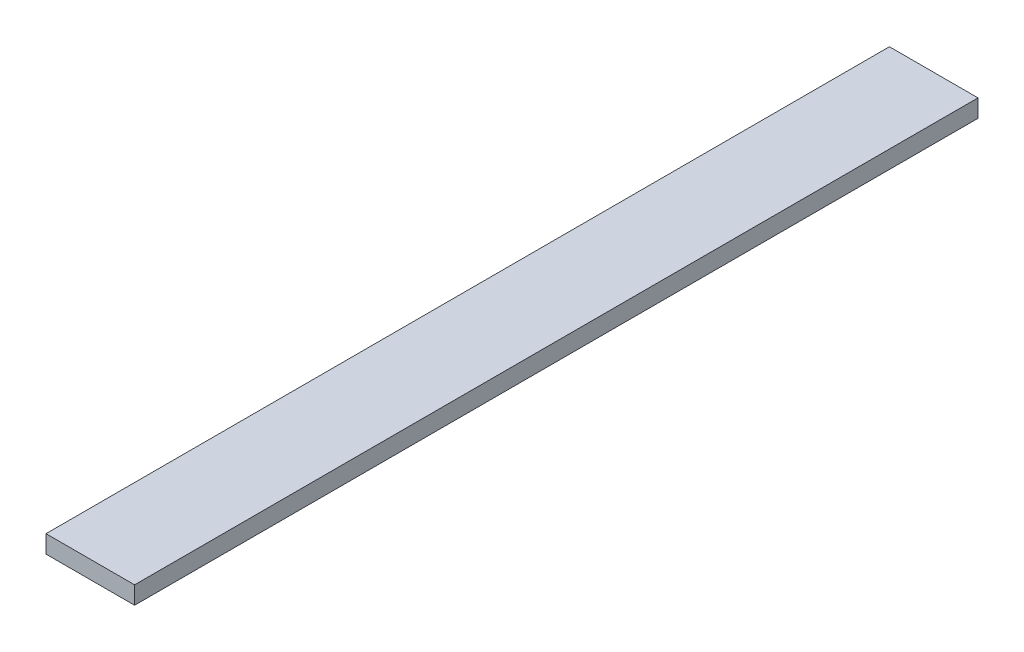
ISO-10303-21;
HEADER;
FILE_DESCRIPTION(('STEP AP214'),'2;1');
FILE_NAME('part.step','',(''),(''),'','','');
FILE_SCHEMA(('AUTOMOTIVE_DESIGN { 1 0 10303 214 1 1 1 1 }'));
ENDSEC;
DATA;
#1=APPLICATION_CONTEXT('core data for automotive mechanical design processes');
#2=APPLICATION_PROTOCOL_DEFINITION('international standard','automotive_design',2000,#1);
#3=PRODUCT_CONTEXT('',#1,'mechanical');
#4=PRODUCT('Part','Part','',(#3));
#5=PRODUCT_RELATED_PRODUCT_CATEGORY('part','',(#4));
#6=PRODUCT_DEFINITION_FORMATION('','',#4);
#7=PRODUCT_DEFINITION_CONTEXT('part definition',#1,'design');
#8=PRODUCT_DEFINITION('design','',#6,#7);
#9=PRODUCT_DEFINITION_SHAPE('','',#8);
#10=(LENGTH_UNIT() NAMED_UNIT(*) SI_UNIT(.MILLI.,.METRE.));
#11=(NAMED_UNIT(*) PLANE_ANGLE_UNIT() SI_UNIT($,.RADIAN.));
#12=(NAMED_UNIT(*) SI_UNIT($,.STERADIAN.) SOLID_ANGLE_UNIT());
#13=UNCERTAINTY_MEASURE_WITH_UNIT(LENGTH_MEASURE(1.E-05),#10,'distance_accuracy_value','');
#14=(GEOMETRIC_REPRESENTATION_CONTEXT(3) GLOBAL_UNCERTAINTY_ASSIGNED_CONTEXT((#13)) GLOBAL_UNIT_ASSIGNED_CONTEXT((#10,
#11,#12)) REPRESENTATION_CONTEXT('',''));
#15=CARTESIAN_POINT('',(0.,0.,0.));
#16=DIRECTION('',(0.,0.,1.));
#17=DIRECTION('',(1.,0.,0.));
#18=AXIS2_PLACEMENT_3D('',#15,#16,#17);
#19=CARTESIAN_POINT('',(0.,2.02999999999,0.));
#20=DIRECTION('',(0.,1.,0.));
#21=DIRECTION('',(0.,0.,1.));
#22=AXIS2_PLACEMENT_3D('',#19,#20,#21);
#23=PLANE('',#22);
#24=DIRECTION('',(1.,0.,0.));
#25=VECTOR('',#24,1.);
#26=CARTESIAN_POINT('',(0.,2.02999999999,0.195));
#27=LINE('',#26,#25);
#28=CARTESIAN_POINT('',(-2.625,2.02999999999,0.195));
#29=VERTEX_POINT('',#28);
#30=CARTESIAN_POINT('',(-2.875,2.02999999999,0.195));
#31=VERTEX_POINT('',#30);
#32=EDGE_CURVE('E19',#29,#31,#27,.F.);
#33=ORIENTED_EDGE('',*,*,#32,.F.);
#34=DIRECTION('',(0.,0.,1.));
#35=VECTOR('',#34,1.);
#36=CARTESIAN_POINT('',(-2.625,2.02999999999,0.195));
#37=LINE('',#36,#35);
#38=CARTESIAN_POINT('',(-2.625,2.02999999999,2.575));
#39=VERTEX_POINT('',#38);
#40=EDGE_CURVE('E68',#29,#39,#37,.T.);
#41=ORIENTED_EDGE('',*,*,#40,.T.);
#42=DIRECTION('',(-1.,0.,0.));
#43=VECTOR('',#42,1.);
#44=CARTESIAN_POINT('',(-2.875,2.02999999999,2.575));
#45=LINE('',#44,#43);
#46=CARTESIAN_POINT('',(-2.875,2.02999999999,2.575));
#47=VERTEX_POINT('',#46);
#48=EDGE_CURVE('E55',#39,#47,#45,.T.);
#49=ORIENTED_EDGE('',*,*,#48,.T.);
#50=DIRECTION('',(0.,0.,1.));
#51=VECTOR('',#50,1.);
#52=CARTESIAN_POINT('',(-2.875,2.02999999999,0.195));
#53=LINE('',#52,#51);
#54=EDGE_CURVE('E61',#47,#31,#53,.F.);
#55=ORIENTED_EDGE('',*,*,#54,.T.);
#56=EDGE_LOOP('',(#33,#41,#49,#55));
#57=FACE_BOUND('',#56,.T.);
#58=ADVANCED_FACE('F16',(#57),#23,.F.);
#59=CARTESIAN_POINT('',(-2.875,2.07999999999,0.195));
#60=DIRECTION('',(1.,0.,0.));
#61=DIRECTION('',(0.,1.,0.));
#62=AXIS2_PLACEMENT_3D('',#59,#60,#61);
#63=PLANE('',#62);
#64=DIRECTION('',(0.,1.,0.));
#65=VECTOR('',#64,1.);
#66=CARTESIAN_POINT('',(-2.875,2.07999999999,2.575));
#67=LINE('',#66,#65);
#68=CARTESIAN_POINT('',(-2.875,2.07999999999,2.575));
#69=VERTEX_POINT('',#68);
#70=EDGE_CURVE('E63',#47,#69,#67,.T.);
#71=ORIENTED_EDGE('',*,*,#70,.T.);
#72=DIRECTION('',(0.,0.,1.));
#73=VECTOR('',#72,1.);
#74=CARTESIAN_POINT('',(-2.875,2.07999999999,0.));
#75=LINE('',#74,#73);
#76=CARTESIAN_POINT('',(-2.875,2.07999999999,0.195));
#77=VERTEX_POINT('',#76);
#78=EDGE_CURVE('E82',#77,#69,#75,.T.);
#79=ORIENTED_EDGE('',*,*,#78,.F.);
#80=DIRECTION('',(0.,1.,0.));
#81=VECTOR('',#80,1.);
#82=CARTESIAN_POINT('',(-2.875,2.07999999999,0.195));
#83=LINE('',#82,#81);
#84=EDGE_CURVE('E66',#77,#31,#83,.F.);
#85=ORIENTED_EDGE('',*,*,#84,.T.);
#86=ORIENTED_EDGE('',*,*,#54,.F.);
#87=EDGE_LOOP('',(#71,#79,#85,#86));
#88=FACE_BOUND('',#87,.T.);
#89=ADVANCED_FACE('F62',(#88),#63,.F.);
#90=CARTESIAN_POINT('',(-2.875,2.07999999999,2.575));
#91=DIRECTION('',(0.,0.,-1.));
#92=DIRECTION('',(-1.,0.,0.));
#93=AXIS2_PLACEMENT_3D('',#90,#91,#92);
#94=PLANE('',#93);
#95=DIRECTION('',(0.,-1.,0.));
#96=VECTOR('',#95,1.);
#97=CARTESIAN_POINT('',(-2.625,2.07999999999,2.575));
#98=LINE('',#97,#96);
#99=CARTESIAN_POINT('',(-2.625,2.07999999999,2.575));
#100=VERTEX_POINT('',#99);
#101=EDGE_CURVE('E70',#39,#100,#98,.F.);
#102=ORIENTED_EDGE('',*,*,#101,.T.);
#103=DIRECTION('',(1.,0.,0.));
#104=VECTOR('',#103,1.);
#105=CARTESIAN_POINT('',(0.,2.07999999999,2.575));
#106=LINE('',#105,#104);
#107=EDGE_CURVE('E74',#69,#100,#106,.T.);
#108=ORIENTED_EDGE('',*,*,#107,.F.);
#109=ORIENTED_EDGE('',*,*,#70,.F.);
#110=ORIENTED_EDGE('',*,*,#48,.F.);
#111=EDGE_LOOP('',(#102,#108,#109,#110));
#112=FACE_BOUND('',#111,.T.);
#113=ADVANCED_FACE('F72',(#112),#94,.F.);
#114=CARTESIAN_POINT('',(-2.625,2.07999999999,0.195));
#115=DIRECTION('',(-1.,0.,0.));
#116=DIRECTION('',(0.,-1.,0.));
#117=AXIS2_PLACEMENT_3D('',#114,#115,#116);
#118=PLANE('',#117);
#119=DIRECTION('',(0.,1.,0.));
#120=VECTOR('',#119,1.);
#121=CARTESIAN_POINT('',(-2.625,2.07999999999,0.195));
#122=LINE('',#121,#120);
#123=CARTESIAN_POINT('',(-2.625,2.07999999999,0.195));
#124=VERTEX_POINT('',#123);
#125=EDGE_CURVE('E34',#29,#124,#122,.T.);
#126=ORIENTED_EDGE('',*,*,#125,.T.);
#127=DIRECTION('',(0.,0.,1.));
#128=VECTOR('',#127,1.);
#129=CARTESIAN_POINT('',(-2.625,2.07999999999,0.));
#130=LINE('',#129,#128);
#131=EDGE_CURVE('E25',#100,#124,#130,.F.);
#132=ORIENTED_EDGE('',*,*,#131,.F.);
#133=ORIENTED_EDGE('',*,*,#101,.F.);
#134=ORIENTED_EDGE('',*,*,#40,.F.);
#135=EDGE_LOOP('',(#126,#132,#133,#134));
#136=FACE_BOUND('',#135,.T.);
#137=ADVANCED_FACE('F88',(#136),#118,.F.);
#138=CARTESIAN_POINT('',(-2.875,2.07999999999,0.195));
#139=DIRECTION('',(0.,0.,1.));
#140=DIRECTION('',(1.,0.,0.));
#141=AXIS2_PLACEMENT_3D('',#138,#139,#140);
#142=PLANE('',#141);
#143=ORIENTED_EDGE('',*,*,#84,.F.);
#144=DIRECTION('',(1.,0.,0.));
#145=VECTOR('',#144,1.);
#146=CARTESIAN_POINT('',(0.,2.07999999999,0.195));
#147=LINE('',#146,#145);
#148=EDGE_CURVE('E11',#124,#77,#147,.F.);
#149=ORIENTED_EDGE('',*,*,#148,.F.);
#150=ORIENTED_EDGE('',*,*,#125,.F.);
#151=ORIENTED_EDGE('',*,*,#32,.T.);
#152=EDGE_LOOP('',(#143,#149,#150,#151));
#153=FACE_BOUND('',#152,.T.);
#154=ADVANCED_FACE('F90',(#153),#142,.F.);
#155=CARTESIAN_POINT('',(0.,2.07999999999,0.));
#156=DIRECTION('',(0.,1.,0.));
#157=DIRECTION('',(0.,0.,1.));
#158=AXIS2_PLACEMENT_3D('',#155,#156,#157);
#159=PLANE('',#158);
#160=ORIENTED_EDGE('',*,*,#131,.T.);
#161=ORIENTED_EDGE('',*,*,#148,.T.);
#162=ORIENTED_EDGE('',*,*,#78,.T.);
#163=ORIENTED_EDGE('',*,*,#107,.T.);
#164=EDGE_LOOP('',(#160,#161,#162,#163));
#165=FACE_BOUND('',#164,.T.);
#166=ADVANCED_FACE('F87',(#165),#159,.T.);
#167=CLOSED_SHELL('',(#58,#89,#113,#137,#154,#166));
#168=MANIFOLD_SOLID_BREP('B1',#167);
#169=ADVANCED_BREP_SHAPE_REPRESENTATION('',(#18,#168),#14);
#170=SHAPE_DEFINITION_REPRESENTATION(#9,#169);
ENDSEC;
END-ISO-10303-21;
